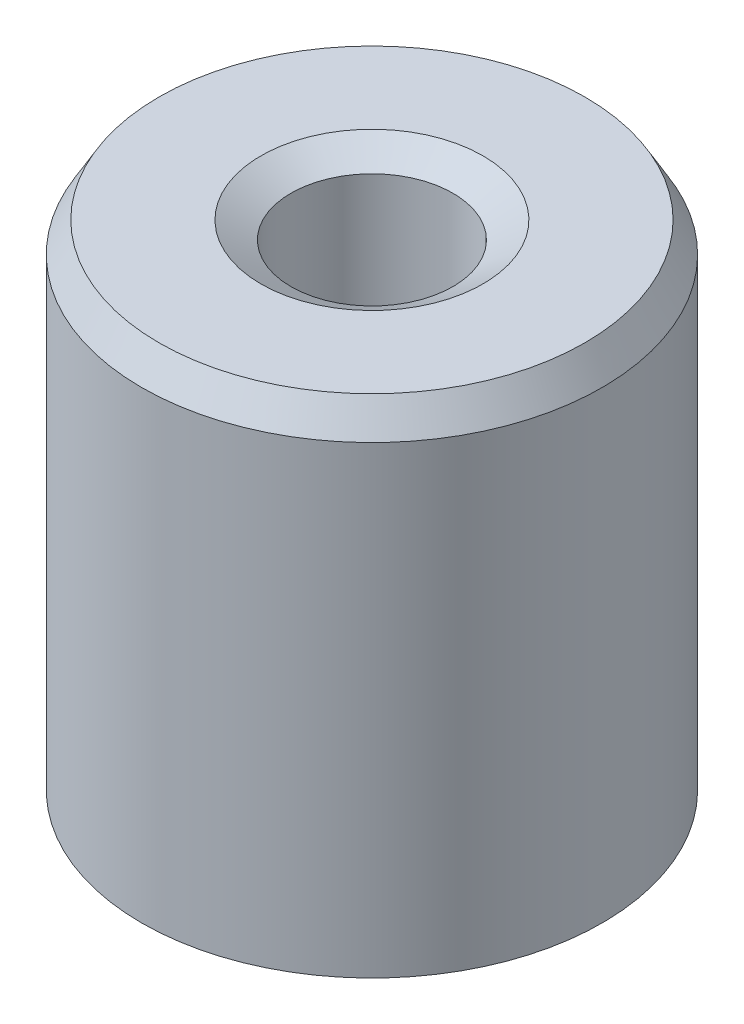
ISO-10303-21;
HEADER;
FILE_DESCRIPTION(('STEP AP214'),'2;1');
FILE_NAME('part.step','',(''),(''),'','','');
FILE_SCHEMA(('AUTOMOTIVE_DESIGN { 1 0 10303 214 1 1 1 1 }'));
ENDSEC;
DATA;
#1=APPLICATION_CONTEXT('core data for automotive mechanical design processes');
#2=APPLICATION_PROTOCOL_DEFINITION('international standard','automotive_design',2000,#1);
#3=PRODUCT_CONTEXT('',#1,'mechanical');
#4=PRODUCT('Part','Part','',(#3));
#5=PRODUCT_RELATED_PRODUCT_CATEGORY('part','',(#4));
#6=PRODUCT_DEFINITION_FORMATION('','',#4);
#7=PRODUCT_DEFINITION_CONTEXT('part definition',#1,'design');
#8=PRODUCT_DEFINITION('design','',#6,#7);
#9=PRODUCT_DEFINITION_SHAPE('','',#8);
#10=(LENGTH_UNIT() NAMED_UNIT(*) SI_UNIT(.MILLI.,.METRE.));
#11=(NAMED_UNIT(*) PLANE_ANGLE_UNIT() SI_UNIT($,.RADIAN.));
#12=(NAMED_UNIT(*) SI_UNIT($,.STERADIAN.) SOLID_ANGLE_UNIT());
#13=UNCERTAINTY_MEASURE_WITH_UNIT(LENGTH_MEASURE(1.E-05),#10,'distance_accuracy_value','');
#14=(GEOMETRIC_REPRESENTATION_CONTEXT(3) GLOBAL_UNCERTAINTY_ASSIGNED_CONTEXT((#13)) GLOBAL_UNIT_ASSIGNED_CONTEXT((#10,
#11,#12)) REPRESENTATION_CONTEXT('',''));
#15=CARTESIAN_POINT('',(0.,0.,0.));
#16=DIRECTION('',(0.,0.,1.));
#17=DIRECTION('',(1.,0.,0.));
#18=AXIS2_PLACEMENT_3D('',#15,#16,#17);
#19=CARTESIAN_POINT('',(0.,22.1941622633524,0.));
#20=DIRECTION('',(0.,-1.,0.));
#21=DIRECTION('',(0.,0.,-1.));
#22=AXIS2_PLACEMENT_3D('',#19,#20,#21);
#23=CYLINDRICAL_SURFACE('',#22,10.);
#24=CARTESIAN_POINT('',(0.,0.752966170262718,0.));
#25=DIRECTION('',(0.,1.,0.));
#26=DIRECTION('',(0.,0.,1.));
#27=AXIS2_PLACEMENT_3D('',#24,#25,#26);
#28=CIRCLE('',#27,10.);
#29=CARTESIAN_POINT('',(0.,0.752966170262718,10.));
#30=VERTEX_POINT('',#29);
#31=EDGE_CURVE('E10',#30,#30,#28,.T.);
#32=ORIENTED_EDGE('',*,*,#31,.T.);
#33=EDGE_LOOP('',(#32));
#34=FACE_BOUND('',#33,.T.);
#35=CARTESIAN_POINT('',(0.,20.8899866000768,0.));
#36=DIRECTION('',(0.,1.,0.));
#37=DIRECTION('',(0.,0.,1.));
#38=AXIS2_PLACEMENT_3D('',#35,#36,#37);
#39=CIRCLE('',#38,10.);
#40=CARTESIAN_POINT('',(0.,20.8899866000768,10.));
#41=VERTEX_POINT('',#40);
#42=EDGE_CURVE('E50',#41,#41,#39,.F.);
#43=ORIENTED_EDGE('',*,*,#42,.T.);
#44=EDGE_LOOP('',(#43));
#45=FACE_BOUND('',#44,.T.);
#46=ADVANCED_FACE('F39',(#34,#45),#23,.T.);
#47=CARTESIAN_POINT('',(0.,22.1941622633524,0.));
#48=DIRECTION('',(0.,1.,0.));
#49=DIRECTION('',(0.,0.,1.));
#50=AXIS2_PLACEMENT_3D('',#47,#48,#49);
#51=PLANE('',#50);
#52=CARTESIAN_POINT('',(0.,22.1941622633524,0.));
#53=DIRECTION('',(0.,1.,0.));
#54=DIRECTION('',(0.,0.,1.));
#55=AXIS2_PLACEMENT_3D('',#52,#53,#54);
#56=CIRCLE('',#55,4.82101372797706);
#57=CARTESIAN_POINT('',(0.,22.1941622633524,4.82101372797706));
#58=VERTEX_POINT('',#57);
#59=EDGE_CURVE('E58',#58,#58,#56,.F.);
#60=ORIENTED_EDGE('',*,*,#59,.T.);
#61=EDGE_LOOP('',(#60));
#62=FACE_BOUND('',#61,.T.);
#63=CARTESIAN_POINT('',(0.,22.1941622633524,0.));
#64=DIRECTION('',(0.,1.,0.));
#65=DIRECTION('',(0.,0.,1.));
#66=AXIS2_PLACEMENT_3D('',#63,#64,#65);
#67=CIRCLE('',#66,9.24703382973729);
#68=CARTESIAN_POINT('',(0.,22.1941622633524,9.24703382973729));
#69=VERTEX_POINT('',#68);
#70=EDGE_CURVE('E61',#69,#69,#67,.T.);
#71=ORIENTED_EDGE('',*,*,#70,.T.);
#72=EDGE_LOOP('',(#71));
#73=FACE_BOUND('',#72,.T.);
#74=ADVANCED_FACE('F88',(#62,#73),#51,.T.);
#75=CARTESIAN_POINT('',(0.,0.,0.));
#76=DIRECTION('',(0.,1.,0.));
#77=DIRECTION('',(0.,0.,1.));
#78=AXIS2_PLACEMENT_3D('',#75,#76,#77);
#79=PLANE('',#78);
#80=CARTESIAN_POINT('',(0.,0.,0.));
#81=DIRECTION('',(0.,1.,0.));
#82=DIRECTION('',(0.,0.,1.));
#83=AXIS2_PLACEMENT_3D('',#80,#81,#82);
#84=CIRCLE('',#83,4.26980423496419);
#85=CARTESIAN_POINT('',(0.,0.,4.26980423496419));
#86=VERTEX_POINT('',#85);
#87=EDGE_CURVE('E51',#86,#86,#84,.T.);
#88=ORIENTED_EDGE('',*,*,#87,.T.);
#89=EDGE_LOOP('',(#88));
#90=FACE_BOUND('',#89,.T.);
#91=CARTESIAN_POINT('',(0.,0.,0.));
#92=DIRECTION('',(0.,1.,0.));
#93=DIRECTION('',(0.,0.,1.));
#94=AXIS2_PLACEMENT_3D('',#91,#92,#93);
#95=CIRCLE('',#94,8.69582433672441);
#96=CARTESIAN_POINT('',(0.,0.,8.69582433672441));
#97=VERTEX_POINT('',#96);
#98=EDGE_CURVE('E54',#97,#97,#95,.F.);
#99=ORIENTED_EDGE('',*,*,#98,.T.);
#100=EDGE_LOOP('',(#99));
#101=FACE_BOUND('',#100,.T.);
#102=ADVANCED_FACE('F83',(#90,#101),#79,.F.);
#103=CARTESIAN_POINT('',(0.,22.1941622633524,0.));
#104=DIRECTION('',(0.,-1.,0.));
#105=DIRECTION('',(0.,0.,-1.));
#106=AXIS2_PLACEMENT_3D('',#103,#104,#105);
#107=CYLINDRICAL_SURFACE('',#106,3.51683806470147);
#108=CARTESIAN_POINT('',(0.,21.4411960930897,0.));
#109=DIRECTION('',(0.,1.,0.));
#110=DIRECTION('',(0.,0.,1.));
#111=AXIS2_PLACEMENT_3D('',#108,#109,#110);
#112=CIRCLE('',#111,3.51683806470147);
#113=CARTESIAN_POINT('',(0.,21.4411960930897,3.51683806470147));
#114=VERTEX_POINT('',#113);
#115=EDGE_CURVE('E67',#114,#114,#112,.T.);
#116=ORIENTED_EDGE('',*,*,#115,.T.);
#117=EDGE_LOOP('',(#116));
#118=FACE_BOUND('',#117,.T.);
#119=CARTESIAN_POINT('',(0.,1.3041756632756,0.));
#120=DIRECTION('',(0.,1.,0.));
#121=DIRECTION('',(0.,0.,1.));
#122=AXIS2_PLACEMENT_3D('',#119,#120,#121);
#123=CIRCLE('',#122,3.51683806470147);
#124=CARTESIAN_POINT('',(0.,1.3041756632756,3.51683806470147));
#125=VERTEX_POINT('',#124);
#126=EDGE_CURVE('E69',#125,#125,#123,.F.);
#127=ORIENTED_EDGE('',*,*,#126,.T.);
#128=EDGE_LOOP('',(#127));
#129=FACE_BOUND('',#128,.T.);
#130=ADVANCED_FACE('F71',(#118,#129),#107,.F.);
#131=CARTESIAN_POINT('',(0.,21.4411960930897,0.));
#132=DIRECTION('',(0.,1.,0.));
#133=DIRECTION('',(0.,0.,1.));
#134=AXIS2_PLACEMENT_3D('',#131,#132,#133);
#135=CONICAL_SURFACE('',#134,3.51683806470147,1.0471975511966);
#136=ORIENTED_EDGE('',*,*,#59,.F.);
#137=EDGE_LOOP('',(#136));
#138=FACE_BOUND('',#137,.T.);
#139=ORIENTED_EDGE('',*,*,#115,.F.);
#140=EDGE_LOOP('',(#139));
#141=FACE_BOUND('',#140,.T.);
#142=ADVANCED_FACE('F77',(#138,#141),#135,.F.);
#143=CARTESIAN_POINT('',(0.,0.,0.));
#144=DIRECTION('',(0.,-1.,0.));
#145=DIRECTION('',(0.,0.,-1.));
#146=AXIS2_PLACEMENT_3D('',#143,#144,#145);
#147=CONICAL_SURFACE('',#146,4.26980423496419,0.523598775598295);
#148=ORIENTED_EDGE('',*,*,#126,.F.);
#149=EDGE_LOOP('',(#148));
#150=FACE_BOUND('',#149,.T.);
#151=ORIENTED_EDGE('',*,*,#87,.F.);
#152=EDGE_LOOP('',(#151));
#153=FACE_BOUND('',#152,.T.);
#154=ADVANCED_FACE('F73',(#150,#153),#147,.F.);
#155=CARTESIAN_POINT('',(0.,0.752966170262718,0.));
#156=DIRECTION('',(0.,1.,0.));
#157=DIRECTION('',(0.,0.,1.));
#158=AXIS2_PLACEMENT_3D('',#155,#156,#157);
#159=CONICAL_SURFACE('',#158,10.,1.0471975511966);
#160=ORIENTED_EDGE('',*,*,#98,.F.);
#161=EDGE_LOOP('',(#160));
#162=FACE_BOUND('',#161,.T.);
#163=ORIENTED_EDGE('',*,*,#31,.F.);
#164=EDGE_LOOP('',(#163));
#165=FACE_BOUND('',#164,.T.);
#166=ADVANCED_FACE('F76',(#162,#165),#159,.T.);
#167=CARTESIAN_POINT('',(0.,22.1941622633524,0.));
#168=DIRECTION('',(0.,-1.,0.));
#169=DIRECTION('',(0.,0.,-1.));
#170=AXIS2_PLACEMENT_3D('',#167,#168,#169);
#171=CONICAL_SURFACE('',#170,9.24703382973729,0.523598775598295);
#172=ORIENTED_EDGE('',*,*,#42,.F.);
#173=EDGE_LOOP('',(#172));
#174=FACE_BOUND('',#173,.T.);
#175=ORIENTED_EDGE('',*,*,#70,.F.);
#176=EDGE_LOOP('',(#175));
#177=FACE_BOUND('',#176,.T.);
#178=ADVANCED_FACE('F45',(#174,#177),#171,.T.);
#179=CLOSED_SHELL('',(#46,#74,#102,#130,#142,#154,#166,#178));
#180=MANIFOLD_SOLID_BREP('B2',#179);
#181=ADVANCED_BREP_SHAPE_REPRESENTATION('',(#18,#180),#14);
#182=SHAPE_DEFINITION_REPRESENTATION(#9,#181);
ENDSEC;
END-ISO-10303-21;
